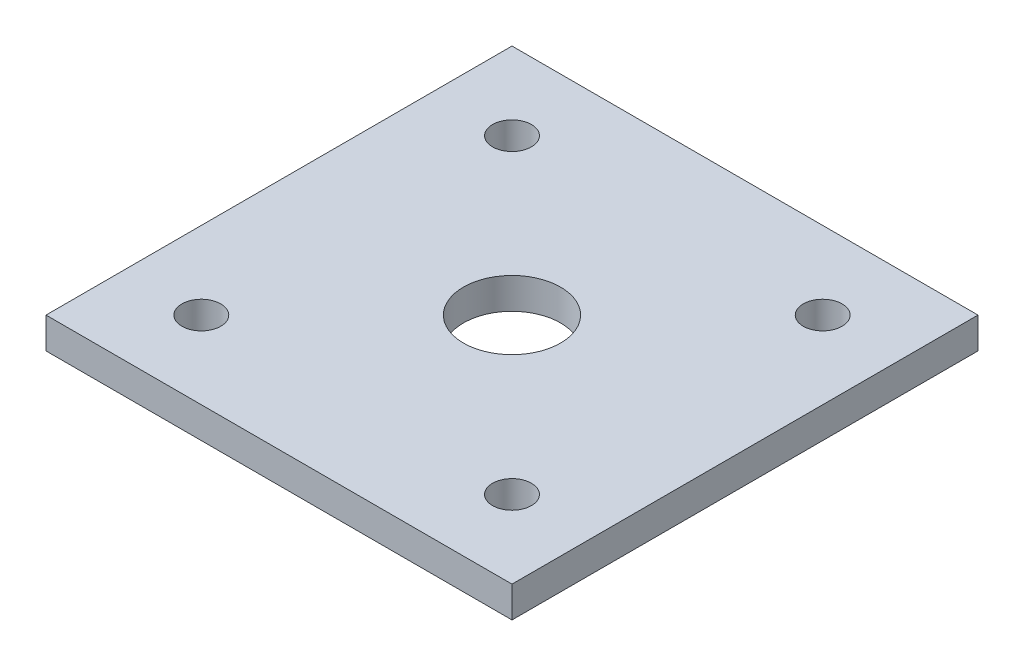
ISO-10303-21;
HEADER;
FILE_DESCRIPTION(('STEP AP214'),'2;1');
FILE_NAME('part.step','',(''),(''),'','','');
FILE_SCHEMA(('AUTOMOTIVE_DESIGN { 1 0 10303 214 1 1 1 1 }'));
ENDSEC;
DATA;
#1=APPLICATION_CONTEXT('core data for automotive mechanical design processes');
#2=APPLICATION_PROTOCOL_DEFINITION('international standard','automotive_design',2000,#1);
#3=PRODUCT_CONTEXT('',#1,'mechanical');
#4=PRODUCT('Part','Part','',(#3));
#5=PRODUCT_RELATED_PRODUCT_CATEGORY('part','',(#4));
#6=PRODUCT_DEFINITION_FORMATION('','',#4);
#7=PRODUCT_DEFINITION_CONTEXT('part definition',#1,'design');
#8=PRODUCT_DEFINITION('design','',#6,#7);
#9=PRODUCT_DEFINITION_SHAPE('','',#8);
#10=(LENGTH_UNIT() NAMED_UNIT(*) SI_UNIT(.MILLI.,.METRE.));
#11=(NAMED_UNIT(*) PLANE_ANGLE_UNIT() SI_UNIT($,.RADIAN.));
#12=(NAMED_UNIT(*) SI_UNIT($,.STERADIAN.) SOLID_ANGLE_UNIT());
#13=UNCERTAINTY_MEASURE_WITH_UNIT(LENGTH_MEASURE(1.E-05),#10,'distance_accuracy_value','');
#14=(GEOMETRIC_REPRESENTATION_CONTEXT(3) GLOBAL_UNCERTAINTY_ASSIGNED_CONTEXT((#13)) GLOBAL_UNIT_ASSIGNED_CONTEXT((#10,
#11,#12)) REPRESENTATION_CONTEXT('',''));
#15=CARTESIAN_POINT('',(0.,0.,0.));
#16=DIRECTION('',(0.,0.,1.));
#17=DIRECTION('',(1.,0.,0.));
#18=AXIS2_PLACEMENT_3D('',#15,#16,#17);
#19=CARTESIAN_POINT('',(0.,8.,60.));
#20=DIRECTION('',(0.,0.,-1.));
#21=DIRECTION('',(-1.,0.,0.));
#22=AXIS2_PLACEMENT_3D('',#19,#20,#21);
#23=PLANE('',#22);
#24=DIRECTION('',(1.,0.,0.));
#25=VECTOR('',#24,1.);
#26=CARTESIAN_POINT('',(0.,0.,60.));
#27=LINE('',#26,#25);
#28=CARTESIAN_POINT('',(-60.,0.,60.));
#29=VERTEX_POINT('',#28);
#30=CARTESIAN_POINT('',(60.,0.,60.));
#31=VERTEX_POINT('',#30);
#32=EDGE_CURVE('E110',#29,#31,#27,.T.);
#33=ORIENTED_EDGE('',*,*,#32,.T.);
#34=DIRECTION('',(0.,-1.,0.));
#35=VECTOR('',#34,1.);
#36=CARTESIAN_POINT('',(60.,8.,60.));
#37=LINE('',#36,#35);
#38=CARTESIAN_POINT('',(60.,8.,60.));
#39=VERTEX_POINT('',#38);
#40=EDGE_CURVE('E11',#39,#31,#37,.T.);
#41=ORIENTED_EDGE('',*,*,#40,.F.);
#42=DIRECTION('',(1.,0.,0.));
#43=VECTOR('',#42,1.);
#44=CARTESIAN_POINT('',(0.,8.,60.));
#45=LINE('',#44,#43);
#46=CARTESIAN_POINT('',(-60.,8.,60.));
#47=VERTEX_POINT('',#46);
#48=EDGE_CURVE('E83',#47,#39,#45,.T.);
#49=ORIENTED_EDGE('',*,*,#48,.F.);
#50=DIRECTION('',(0.,-1.,0.));
#51=VECTOR('',#50,1.);
#52=CARTESIAN_POINT('',(-60.,8.,60.));
#53=LINE('',#52,#51);
#54=EDGE_CURVE('E106',#47,#29,#53,.T.);
#55=ORIENTED_EDGE('',*,*,#54,.T.);
#56=EDGE_LOOP('',(#33,#41,#49,#55));
#57=FACE_BOUND('',#56,.T.);
#58=ADVANCED_FACE('F43',(#57),#23,.F.);
#59=CARTESIAN_POINT('',(60.,8.,0.));
#60=DIRECTION('',(1.,0.,0.));
#61=DIRECTION('',(0.,0.,-1.));
#62=AXIS2_PLACEMENT_3D('',#59,#60,#61);
#63=PLANE('',#62);
#64=DIRECTION('',(0.,0.,1.));
#65=VECTOR('',#64,1.);
#66=CARTESIAN_POINT('',(60.,0.,0.));
#67=LINE('',#66,#65);
#68=CARTESIAN_POINT('',(60.,0.,-60.));
#69=VERTEX_POINT('',#68);
#70=EDGE_CURVE('E92',#69,#31,#67,.T.);
#71=ORIENTED_EDGE('',*,*,#70,.F.);
#72=DIRECTION('',(0.,-1.,0.));
#73=VECTOR('',#72,1.);
#74=CARTESIAN_POINT('',(60.,8.,-60.));
#75=LINE('',#74,#73);
#76=CARTESIAN_POINT('',(60.,8.,-60.));
#77=VERTEX_POINT('',#76);
#78=EDGE_CURVE('E52',#77,#69,#75,.T.);
#79=ORIENTED_EDGE('',*,*,#78,.F.);
#80=DIRECTION('',(0.,0.,1.));
#81=VECTOR('',#80,1.);
#82=CARTESIAN_POINT('',(60.,8.,0.));
#83=LINE('',#82,#81);
#84=EDGE_CURVE('E90',#77,#39,#83,.T.);
#85=ORIENTED_EDGE('',*,*,#84,.T.);
#86=ORIENTED_EDGE('',*,*,#40,.T.);
#87=EDGE_LOOP('',(#71,#79,#85,#86));
#88=FACE_BOUND('',#87,.T.);
#89=ADVANCED_FACE('F89',(#88),#63,.T.);
#90=CARTESIAN_POINT('',(0.,8.,-60.));
#91=DIRECTION('',(0.,0.,-1.));
#92=DIRECTION('',(-1.,0.,0.));
#93=AXIS2_PLACEMENT_3D('',#90,#91,#92);
#94=PLANE('',#93);
#95=DIRECTION('',(1.,0.,0.));
#96=VECTOR('',#95,1.);
#97=CARTESIAN_POINT('',(0.,0.,-60.));
#98=LINE('',#97,#96);
#99=CARTESIAN_POINT('',(-60.,0.,-60.));
#100=VERTEX_POINT('',#99);
#101=EDGE_CURVE('E117',#100,#69,#98,.T.);
#102=ORIENTED_EDGE('',*,*,#101,.F.);
#103=DIRECTION('',(0.,-1.,0.));
#104=VECTOR('',#103,1.);
#105=CARTESIAN_POINT('',(-60.,8.,-60.));
#106=LINE('',#105,#104);
#107=CARTESIAN_POINT('',(-60.,8.,-60.));
#108=VERTEX_POINT('',#107);
#109=EDGE_CURVE('E75',#108,#100,#106,.T.);
#110=ORIENTED_EDGE('',*,*,#109,.F.);
#111=DIRECTION('',(1.,0.,0.));
#112=VECTOR('',#111,1.);
#113=CARTESIAN_POINT('',(0.,8.,-60.));
#114=LINE('',#113,#112);
#115=EDGE_CURVE('E99',#108,#77,#114,.T.);
#116=ORIENTED_EDGE('',*,*,#115,.T.);
#117=ORIENTED_EDGE('',*,*,#78,.T.);
#118=EDGE_LOOP('',(#102,#110,#116,#117));
#119=FACE_BOUND('',#118,.T.);
#120=ADVANCED_FACE('F102',(#119),#94,.T.);
#121=CARTESIAN_POINT('',(-60.,8.,0.));
#122=DIRECTION('',(1.,0.,0.));
#123=DIRECTION('',(0.,0.,-1.));
#124=AXIS2_PLACEMENT_3D('',#121,#122,#123);
#125=PLANE('',#124);
#126=DIRECTION('',(0.,0.,1.));
#127=VECTOR('',#126,1.);
#128=CARTESIAN_POINT('',(-60.,0.,0.));
#129=LINE('',#128,#127);
#130=EDGE_CURVE('E78',#100,#29,#129,.T.);
#131=ORIENTED_EDGE('',*,*,#130,.T.);
#132=ORIENTED_EDGE('',*,*,#54,.F.);
#133=DIRECTION('',(0.,0.,1.));
#134=VECTOR('',#133,1.);
#135=CARTESIAN_POINT('',(-60.,8.,0.));
#136=LINE('',#135,#134);
#137=EDGE_CURVE('E60',#108,#47,#136,.T.);
#138=ORIENTED_EDGE('',*,*,#137,.F.);
#139=ORIENTED_EDGE('',*,*,#109,.T.);
#140=EDGE_LOOP('',(#131,#132,#138,#139));
#141=FACE_BOUND('',#140,.T.);
#142=ADVANCED_FACE('F140',(#141),#125,.F.);
#143=CARTESIAN_POINT('',(0.,8.,0.));
#144=DIRECTION('',(0.,1.,0.));
#145=DIRECTION('',(0.,0.,1.));
#146=AXIS2_PLACEMENT_3D('',#143,#144,#145);
#147=PLANE('',#146);
#148=CARTESIAN_POINT('',(-40.,8.,40.));
#149=DIRECTION('',(0.,-1.,0.));
#150=DIRECTION('',(0.,0.,-1.));
#151=AXIS2_PLACEMENT_3D('',#148,#149,#150);
#152=CIRCLE('',#151,5.);
#153=CARTESIAN_POINT('',(-40.,8.,35.));
#154=VERTEX_POINT('',#153);
#155=EDGE_CURVE('E268',#154,#154,#152,.T.);
#156=ORIENTED_EDGE('',*,*,#155,.T.);
#157=EDGE_LOOP('',(#156));
#158=FACE_BOUND('',#157,.T.);
#159=CARTESIAN_POINT('',(40.,8.,40.));
#160=DIRECTION('',(0.,1.,0.));
#161=DIRECTION('',(0.,0.,-1.));
#162=AXIS2_PLACEMENT_3D('',#159,#160,#161);
#163=CIRCLE('',#162,5.);
#164=CARTESIAN_POINT('',(40.,8.,35.));
#165=VERTEX_POINT('',#164);
#166=EDGE_CURVE('E260',#165,#165,#163,.T.);
#167=ORIENTED_EDGE('',*,*,#166,.F.);
#168=EDGE_LOOP('',(#167));
#169=FACE_BOUND('',#168,.T.);
#170=CARTESIAN_POINT('',(40.,8.,-40.));
#171=DIRECTION('',(0.,-1.,0.));
#172=DIRECTION('',(0.,0.,1.));
#173=AXIS2_PLACEMENT_3D('',#170,#171,#172);
#174=CIRCLE('',#173,5.);
#175=CARTESIAN_POINT('',(40.,8.,-35.));
#176=VERTEX_POINT('',#175);
#177=EDGE_CURVE('E241',#176,#176,#174,.T.);
#178=ORIENTED_EDGE('',*,*,#177,.T.);
#179=EDGE_LOOP('',(#178));
#180=FACE_BOUND('',#179,.T.);
#181=CARTESIAN_POINT('',(-40.,8.,-40.));
#182=DIRECTION('',(0.,1.,0.));
#183=DIRECTION('',(0.,0.,1.));
#184=AXIS2_PLACEMENT_3D('',#181,#182,#183);
#185=CIRCLE('',#184,5.);
#186=CARTESIAN_POINT('',(-40.,8.,-35.));
#187=VERTEX_POINT('',#186);
#188=EDGE_CURVE('E231',#187,#187,#185,.T.);
#189=ORIENTED_EDGE('',*,*,#188,.F.);
#190=EDGE_LOOP('',(#189));
#191=FACE_BOUND('',#190,.T.);
#192=CARTESIAN_POINT('',(0.,8.,0.));
#193=DIRECTION('',(0.,1.,0.));
#194=DIRECTION('',(0.,0.,1.));
#195=AXIS2_PLACEMENT_3D('',#192,#193,#194);
#196=CIRCLE('',#195,12.5);
#197=CARTESIAN_POINT('',(0.,8.,12.5));
#198=VERTEX_POINT('',#197);
#199=EDGE_CURVE('E238',#198,#198,#196,.T.);
#200=ORIENTED_EDGE('',*,*,#199,.F.);
#201=EDGE_LOOP('',(#200));
#202=FACE_BOUND('',#201,.T.);
#203=ORIENTED_EDGE('',*,*,#48,.T.);
#204=ORIENTED_EDGE('',*,*,#84,.F.);
#205=ORIENTED_EDGE('',*,*,#115,.F.);
#206=ORIENTED_EDGE('',*,*,#137,.T.);
#207=EDGE_LOOP('',(#203,#204,#205,#206));
#208=FACE_BOUND('',#207,.T.);
#209=ADVANCED_FACE('F98',(#158,#169,#180,#191,#202,#208),#147,.T.);
#210=CARTESIAN_POINT('',(0.,0.,0.));
#211=DIRECTION('',(0.,1.,0.));
#212=DIRECTION('',(0.,0.,1.));
#213=AXIS2_PLACEMENT_3D('',#210,#211,#212);
#214=PLANE('',#213);
#215=CARTESIAN_POINT('',(-40.,0.,40.));
#216=DIRECTION('',(0.,-1.,0.));
#217=DIRECTION('',(0.,0.,-1.));
#218=AXIS2_PLACEMENT_3D('',#215,#216,#217);
#219=CIRCLE('',#218,5.);
#220=CARTESIAN_POINT('',(-40.,0.,35.));
#221=VERTEX_POINT('',#220);
#222=EDGE_CURVE('E264',#221,#221,#219,.T.);
#223=ORIENTED_EDGE('',*,*,#222,.F.);
#224=EDGE_LOOP('',(#223));
#225=FACE_BOUND('',#224,.T.);
#226=CARTESIAN_POINT('',(40.,0.,40.));
#227=DIRECTION('',(0.,1.,0.));
#228=DIRECTION('',(0.,0.,-1.));
#229=AXIS2_PLACEMENT_3D('',#226,#227,#228);
#230=CIRCLE('',#229,5.);
#231=CARTESIAN_POINT('',(40.,0.,35.));
#232=VERTEX_POINT('',#231);
#233=EDGE_CURVE('E258',#232,#232,#230,.T.);
#234=ORIENTED_EDGE('',*,*,#233,.T.);
#235=EDGE_LOOP('',(#234));
#236=FACE_BOUND('',#235,.T.);
#237=CARTESIAN_POINT('',(40.,0.,-40.));
#238=DIRECTION('',(0.,-1.,0.));
#239=DIRECTION('',(0.,0.,1.));
#240=AXIS2_PLACEMENT_3D('',#237,#238,#239);
#241=CIRCLE('',#240,5.);
#242=CARTESIAN_POINT('',(40.,0.,-35.));
#243=VERTEX_POINT('',#242);
#244=EDGE_CURVE('E234',#243,#243,#241,.T.);
#245=ORIENTED_EDGE('',*,*,#244,.F.);
#246=EDGE_LOOP('',(#245));
#247=FACE_BOUND('',#246,.T.);
#248=CARTESIAN_POINT('',(-40.,0.,-40.));
#249=DIRECTION('',(0.,1.,0.));
#250=DIRECTION('',(0.,0.,1.));
#251=AXIS2_PLACEMENT_3D('',#248,#249,#250);
#252=CIRCLE('',#251,5.);
#253=CARTESIAN_POINT('',(-40.,0.,-35.));
#254=VERTEX_POINT('',#253);
#255=EDGE_CURVE('E228',#254,#254,#252,.T.);
#256=ORIENTED_EDGE('',*,*,#255,.T.);
#257=EDGE_LOOP('',(#256));
#258=FACE_BOUND('',#257,.T.);
#259=CARTESIAN_POINT('',(0.,0.,0.));
#260=DIRECTION('',(0.,1.,0.));
#261=DIRECTION('',(0.,0.,1.));
#262=AXIS2_PLACEMENT_3D('',#259,#260,#261);
#263=CIRCLE('',#262,12.5);
#264=CARTESIAN_POINT('',(0.,0.,12.5));
#265=VERTEX_POINT('',#264);
#266=EDGE_CURVE('E114',#265,#265,#263,.T.);
#267=ORIENTED_EDGE('',*,*,#266,.T.);
#268=EDGE_LOOP('',(#267));
#269=FACE_BOUND('',#268,.T.);
#270=ORIENTED_EDGE('',*,*,#32,.F.);
#271=ORIENTED_EDGE('',*,*,#130,.F.);
#272=ORIENTED_EDGE('',*,*,#101,.T.);
#273=ORIENTED_EDGE('',*,*,#70,.T.);
#274=EDGE_LOOP('',(#270,#271,#272,#273));
#275=FACE_BOUND('',#274,.T.);
#276=ADVANCED_FACE('F128',(#225,#236,#247,#258,#269,#275),#214,.F.);
#277=CARTESIAN_POINT('',(0.,0.,0.));
#278=DIRECTION('',(0.,1.,0.));
#279=DIRECTION('',(0.,0.,1.));
#280=AXIS2_PLACEMENT_3D('',#277,#278,#279);
#281=CYLINDRICAL_SURFACE('',#280,12.5);
#282=ORIENTED_EDGE('',*,*,#266,.F.);
#283=EDGE_LOOP('',(#282));
#284=FACE_BOUND('',#283,.T.);
#285=ORIENTED_EDGE('',*,*,#199,.T.);
#286=EDGE_LOOP('',(#285));
#287=FACE_BOUND('',#286,.T.);
#288=ADVANCED_FACE('F130',(#284,#287),#281,.F.);
#289=CARTESIAN_POINT('',(-40.,0.,-40.));
#290=DIRECTION('',(0.,1.,0.));
#291=DIRECTION('',(0.,0.,1.));
#292=AXIS2_PLACEMENT_3D('',#289,#290,#291);
#293=CYLINDRICAL_SURFACE('',#292,5.);
#294=ORIENTED_EDGE('',*,*,#255,.F.);
#295=EDGE_LOOP('',(#294));
#296=FACE_BOUND('',#295,.T.);
#297=ORIENTED_EDGE('',*,*,#188,.T.);
#298=EDGE_LOOP('',(#297));
#299=FACE_BOUND('',#298,.T.);
#300=ADVANCED_FACE('F137',(#296,#299),#293,.F.);
#301=CARTESIAN_POINT('',(40.,0.,-40.));
#302=DIRECTION('',(0.,1.,0.));
#303=DIRECTION('',(0.,0.,1.));
#304=AXIS2_PLACEMENT_3D('',#301,#302,#303);
#305=CYLINDRICAL_SURFACE('',#304,5.);
#306=ORIENTED_EDGE('',*,*,#244,.T.);
#307=EDGE_LOOP('',(#306));
#308=FACE_BOUND('',#307,.T.);
#309=ORIENTED_EDGE('',*,*,#177,.F.);
#310=EDGE_LOOP('',(#309));
#311=FACE_BOUND('',#310,.T.);
#312=ADVANCED_FACE('F171',(#308,#311),#305,.F.);
#313=CARTESIAN_POINT('',(40.,0.,40.));
#314=DIRECTION('',(0.,1.,0.));
#315=DIRECTION('',(0.,0.,1.));
#316=AXIS2_PLACEMENT_3D('',#313,#314,#315);
#317=CYLINDRICAL_SURFACE('',#316,5.);
#318=ORIENTED_EDGE('',*,*,#233,.F.);
#319=EDGE_LOOP('',(#318));
#320=FACE_BOUND('',#319,.T.);
#321=ORIENTED_EDGE('',*,*,#166,.T.);
#322=EDGE_LOOP('',(#321));
#323=FACE_BOUND('',#322,.T.);
#324=ADVANCED_FACE('F183',(#320,#323),#317,.F.);
#325=CARTESIAN_POINT('',(-40.,0.,40.));
#326=DIRECTION('',(0.,1.,0.));
#327=DIRECTION('',(0.,0.,1.));
#328=AXIS2_PLACEMENT_3D('',#325,#326,#327);
#329=CYLINDRICAL_SURFACE('',#328,5.);
#330=ORIENTED_EDGE('',*,*,#222,.T.);
#331=EDGE_LOOP('',(#330));
#332=FACE_BOUND('',#331,.T.);
#333=ORIENTED_EDGE('',*,*,#155,.F.);
#334=EDGE_LOOP('',(#333));
#335=FACE_BOUND('',#334,.T.);
#336=ADVANCED_FACE('F189',(#332,#335),#329,.F.);
#337=CLOSED_SHELL('',(#58,#89,#120,#142,#209,#276,#288,#300,#312,#324,#336));
#338=MANIFOLD_SOLID_BREP('B2',#337);
#339=ADVANCED_BREP_SHAPE_REPRESENTATION('',(#18,#338),#14);
#340=SHAPE_DEFINITION_REPRESENTATION(#9,#339);
ENDSEC;
END-ISO-10303-21;
